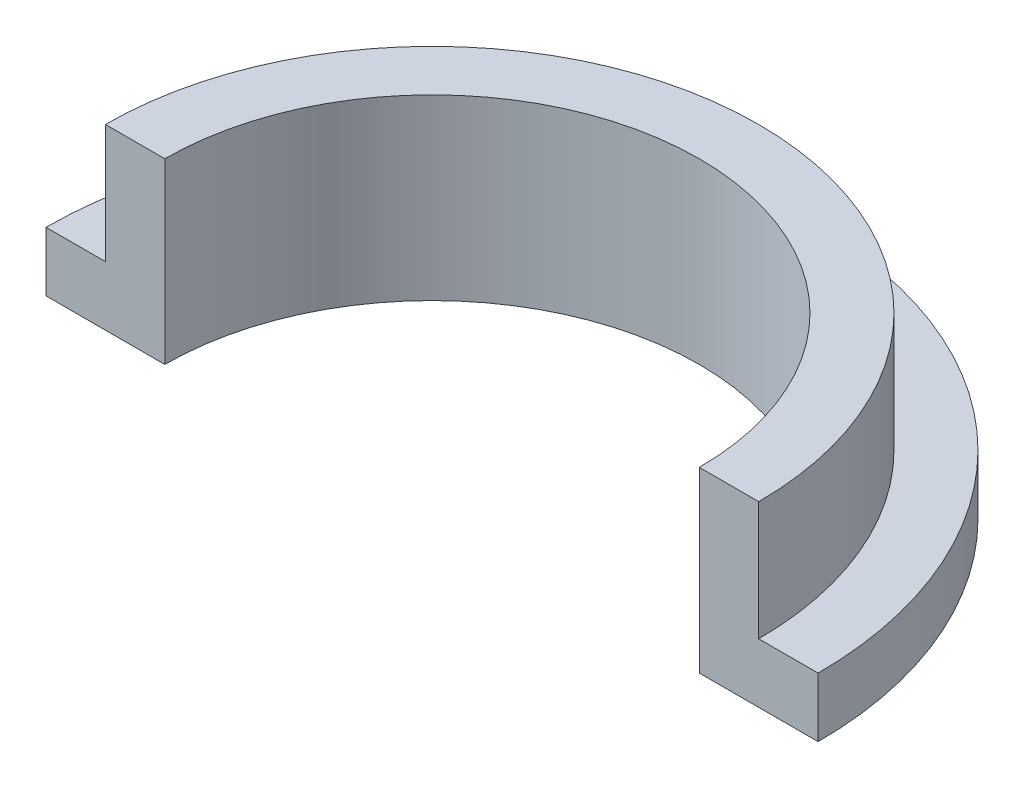
ISO-10303-21;
HEADER;
FILE_DESCRIPTION(('STEP AP214'),'2;1');
FILE_NAME('part.step','',(''),(''),'','','');
FILE_SCHEMA(('AUTOMOTIVE_DESIGN { 1 0 10303 214 1 1 1 1 }'));
ENDSEC;
DATA;
#1=APPLICATION_CONTEXT('core data for automotive mechanical design processes');
#2=APPLICATION_PROTOCOL_DEFINITION('international standard','automotive_design',2000,#1);
#3=PRODUCT_CONTEXT('',#1,'mechanical');
#4=PRODUCT('Part','Part','',(#3));
#5=PRODUCT_RELATED_PRODUCT_CATEGORY('part','',(#4));
#6=PRODUCT_DEFINITION_FORMATION('','',#4);
#7=PRODUCT_DEFINITION_CONTEXT('part definition',#1,'design');
#8=PRODUCT_DEFINITION('design','',#6,#7);
#9=PRODUCT_DEFINITION_SHAPE('','',#8);
#10=(LENGTH_UNIT() NAMED_UNIT(*) SI_UNIT(.MILLI.,.METRE.));
#11=(NAMED_UNIT(*) PLANE_ANGLE_UNIT() SI_UNIT($,.RADIAN.));
#12=(NAMED_UNIT(*) SI_UNIT($,.STERADIAN.) SOLID_ANGLE_UNIT());
#13=UNCERTAINTY_MEASURE_WITH_UNIT(LENGTH_MEASURE(1.E-05),#10,'distance_accuracy_value','');
#14=(GEOMETRIC_REPRESENTATION_CONTEXT(3) GLOBAL_UNCERTAINTY_ASSIGNED_CONTEXT((#13)) GLOBAL_UNIT_ASSIGNED_CONTEXT((#10,
#11,#12)) REPRESENTATION_CONTEXT('',''));
#15=CARTESIAN_POINT('',(0.,0.,0.));
#16=DIRECTION('',(0.,0.,1.));
#17=DIRECTION('',(1.,0.,0.));
#18=AXIS2_PLACEMENT_3D('',#15,#16,#17);
#19=CARTESIAN_POINT('',(0.,6.,0.));
#20=DIRECTION('',(0.,-1.,0.));
#21=DIRECTION('',(0.,0.,-1.));
#22=AXIS2_PLACEMENT_3D('',#19,#20,#21);
#23=CYLINDRICAL_SURFACE('',#22,13.);
#24=CARTESIAN_POINT('',(0.,2.,0.));
#25=DIRECTION('',(0.,1.,0.));
#26=DIRECTION('',(0.,0.,1.));
#27=AXIS2_PLACEMENT_3D('',#24,#25,#26);
#28=CIRCLE('',#27,13.);
#29=CARTESIAN_POINT('',(13.,2.,0.));
#30=VERTEX_POINT('',#29);
#31=CARTESIAN_POINT('',(-13.,2.,0.));
#32=VERTEX_POINT('',#31);
#33=EDGE_CURVE('E126',#30,#32,#28,.T.);
#34=ORIENTED_EDGE('',*,*,#33,.F.);
#35=DIRECTION('',(0.,-1.,0.));
#36=VECTOR('',#35,1.);
#37=CARTESIAN_POINT('',(13.,6.,0.));
#38=LINE('',#37,#36);
#39=CARTESIAN_POINT('',(13.,0.,0.));
#40=VERTEX_POINT('',#39);
#41=EDGE_CURVE('E48',#30,#40,#38,.T.);
#42=ORIENTED_EDGE('',*,*,#41,.T.);
#43=CARTESIAN_POINT('',(0.,0.,0.));
#44=DIRECTION('',(0.,1.,0.));
#45=DIRECTION('',(0.,0.,1.));
#46=AXIS2_PLACEMENT_3D('',#43,#44,#45);
#47=CIRCLE('',#46,13.);
#48=CARTESIAN_POINT('',(-13.,0.,0.));
#49=VERTEX_POINT('',#48);
#50=EDGE_CURVE('E96',#40,#49,#47,.T.);
#51=ORIENTED_EDGE('',*,*,#50,.T.);
#52=DIRECTION('',(0.,-1.,0.));
#53=VECTOR('',#52,1.);
#54=CARTESIAN_POINT('',(-13.,6.,0.));
#55=LINE('',#54,#53);
#56=EDGE_CURVE('E89',#32,#49,#55,.T.);
#57=ORIENTED_EDGE('',*,*,#56,.F.);
#58=EDGE_LOOP('',(#34,#42,#51,#57));
#59=FACE_BOUND('',#58,.T.);
#60=ADVANCED_FACE('F39',(#59),#23,.T.);
#61=CARTESIAN_POINT('',(0.,6.,0.));
#62=DIRECTION('',(0.,-1.,0.));
#63=DIRECTION('',(0.,0.,-1.));
#64=AXIS2_PLACEMENT_3D('',#61,#62,#63);
#65=CYLINDRICAL_SURFACE('',#64,9.);
#66=CARTESIAN_POINT('',(0.,0.,0.));
#67=DIRECTION('',(0.,-1.,0.));
#68=DIRECTION('',(0.,0.,1.));
#69=AXIS2_PLACEMENT_3D('',#66,#67,#68);
#70=CIRCLE('',#69,9.);
#71=CARTESIAN_POINT('',(-9.,0.,0.));
#72=VERTEX_POINT('',#71);
#73=CARTESIAN_POINT('',(9.,0.,0.));
#74=VERTEX_POINT('',#73);
#75=EDGE_CURVE('E101',#72,#74,#70,.T.);
#76=ORIENTED_EDGE('',*,*,#75,.T.);
#77=DIRECTION('',(0.,-1.,0.));
#78=VECTOR('',#77,1.);
#79=CARTESIAN_POINT('',(9.,6.,0.));
#80=LINE('',#79,#78);
#81=CARTESIAN_POINT('',(9.,6.,0.));
#82=VERTEX_POINT('',#81);
#83=EDGE_CURVE('E11',#82,#74,#80,.T.);
#84=ORIENTED_EDGE('',*,*,#83,.F.);
#85=CARTESIAN_POINT('',(0.,6.,0.));
#86=DIRECTION('',(0.,-1.,0.));
#87=DIRECTION('',(0.,0.,1.));
#88=AXIS2_PLACEMENT_3D('',#85,#86,#87);
#89=CIRCLE('',#88,9.);
#90=CARTESIAN_POINT('',(-9.,6.,0.));
#91=VERTEX_POINT('',#90);
#92=EDGE_CURVE('E95',#91,#82,#89,.T.);
#93=ORIENTED_EDGE('',*,*,#92,.F.);
#94=DIRECTION('',(0.,-1.,0.));
#95=VECTOR('',#94,1.);
#96=CARTESIAN_POINT('',(-9.,6.,0.));
#97=LINE('',#96,#95);
#98=EDGE_CURVE('E85',#91,#72,#97,.T.);
#99=ORIENTED_EDGE('',*,*,#98,.T.);
#100=EDGE_LOOP('',(#76,#84,#93,#99));
#101=FACE_BOUND('',#100,.T.);
#102=ADVANCED_FACE('F41',(#101),#65,.F.);
#103=CARTESIAN_POINT('',(9.,6.,0.));
#104=DIRECTION('',(0.,0.,-1.));
#105=DIRECTION('',(-1.,0.,0.));
#106=AXIS2_PLACEMENT_3D('',#103,#104,#105);
#107=PLANE('',#106);
#108=DIRECTION('',(1.,0.,0.));
#109=VECTOR('',#108,1.);
#110=CARTESIAN_POINT('',(11.,2.,0.));
#111=LINE('',#110,#109);
#112=CARTESIAN_POINT('',(11.,2.,0.));
#113=VERTEX_POINT('',#112);
#114=EDGE_CURVE('E140',#113,#30,#111,.T.);
#115=ORIENTED_EDGE('',*,*,#114,.F.);
#116=DIRECTION('',(0.,1.,0.));
#117=VECTOR('',#116,1.);
#118=CARTESIAN_POINT('',(11.,2.,0.));
#119=LINE('',#118,#117);
#120=CARTESIAN_POINT('',(11.,6.,0.));
#121=VERTEX_POINT('',#120);
#122=EDGE_CURVE('E108',#113,#121,#119,.T.);
#123=ORIENTED_EDGE('',*,*,#122,.T.);
#124=DIRECTION('',(1.,0.,0.));
#125=VECTOR('',#124,1.);
#126=CARTESIAN_POINT('',(9.,6.,0.));
#127=LINE('',#126,#125);
#128=EDGE_CURVE('E131',#82,#121,#127,.T.);
#129=ORIENTED_EDGE('',*,*,#128,.F.);
#130=ORIENTED_EDGE('',*,*,#83,.T.);
#131=DIRECTION('',(1.,0.,0.));
#132=VECTOR('',#131,1.);
#133=CARTESIAN_POINT('',(9.,0.,0.));
#134=LINE('',#133,#132);
#135=EDGE_CURVE('E106',#74,#40,#134,.T.);
#136=ORIENTED_EDGE('',*,*,#135,.T.);
#137=ORIENTED_EDGE('',*,*,#41,.F.);
#138=EDGE_LOOP('',(#115,#123,#129,#130,#136,#137));
#139=FACE_BOUND('',#138,.T.);
#140=ADVANCED_FACE('F129',(#139),#107,.F.);
#141=CARTESIAN_POINT('',(-13.,6.,0.));
#142=DIRECTION('',(0.,0.,-1.));
#143=DIRECTION('',(-1.,0.,0.));
#144=AXIS2_PLACEMENT_3D('',#141,#142,#143);
#145=PLANE('',#144);
#146=DIRECTION('',(1.,0.,0.));
#147=VECTOR('',#146,1.);
#148=CARTESIAN_POINT('',(-13.,6.,0.));
#149=LINE('',#148,#147);
#150=CARTESIAN_POINT('',(-11.,6.,0.));
#151=VERTEX_POINT('',#150);
#152=EDGE_CURVE('E63',#151,#91,#149,.T.);
#153=ORIENTED_EDGE('',*,*,#152,.F.);
#154=DIRECTION('',(0.,1.,0.));
#155=VECTOR('',#154,1.);
#156=CARTESIAN_POINT('',(-11.,2.,0.));
#157=LINE('',#156,#155);
#158=CARTESIAN_POINT('',(-11.,2.,0.));
#159=VERTEX_POINT('',#158);
#160=EDGE_CURVE('E55',#159,#151,#157,.T.);
#161=ORIENTED_EDGE('',*,*,#160,.F.);
#162=DIRECTION('',(1.,0.,0.));
#163=VECTOR('',#162,1.);
#164=CARTESIAN_POINT('',(-13.,2.,0.));
#165=LINE('',#164,#163);
#166=EDGE_CURVE('E152',#32,#159,#165,.T.);
#167=ORIENTED_EDGE('',*,*,#166,.F.);
#168=ORIENTED_EDGE('',*,*,#56,.T.);
#169=DIRECTION('',(1.,0.,0.));
#170=VECTOR('',#169,1.);
#171=CARTESIAN_POINT('',(-13.,0.,0.));
#172=LINE('',#171,#170);
#173=EDGE_CURVE('E82',#49,#72,#172,.T.);
#174=ORIENTED_EDGE('',*,*,#173,.T.);
#175=ORIENTED_EDGE('',*,*,#98,.F.);
#176=EDGE_LOOP('',(#153,#161,#167,#168,#174,#175));
#177=FACE_BOUND('',#176,.T.);
#178=ADVANCED_FACE('F84',(#177),#145,.F.);
#179=CARTESIAN_POINT('',(0.,6.,0.));
#180=DIRECTION('',(0.,1.,0.));
#181=DIRECTION('',(0.,0.,1.));
#182=AXIS2_PLACEMENT_3D('',#179,#180,#181);
#183=PLANE('',#182);
#184=CARTESIAN_POINT('',(0.,6.,0.));
#185=DIRECTION('',(0.,-1.,0.));
#186=DIRECTION('',(0.,0.,1.));
#187=AXIS2_PLACEMENT_3D('',#184,#185,#186);
#188=CIRCLE('',#187,11.);
#189=EDGE_CURVE('E142',#151,#121,#188,.T.);
#190=ORIENTED_EDGE('',*,*,#189,.F.);
#191=ORIENTED_EDGE('',*,*,#152,.T.);
#192=ORIENTED_EDGE('',*,*,#92,.T.);
#193=ORIENTED_EDGE('',*,*,#128,.T.);
#194=EDGE_LOOP('',(#190,#191,#192,#193));
#195=FACE_BOUND('',#194,.T.);
#196=ADVANCED_FACE('F135',(#195),#183,.T.);
#197=CARTESIAN_POINT('',(0.,0.,0.));
#198=DIRECTION('',(0.,1.,0.));
#199=DIRECTION('',(0.,0.,1.));
#200=AXIS2_PLACEMENT_3D('',#197,#198,#199);
#201=PLANE('',#200);
#202=ORIENTED_EDGE('',*,*,#75,.F.);
#203=ORIENTED_EDGE('',*,*,#173,.F.);
#204=ORIENTED_EDGE('',*,*,#50,.F.);
#205=ORIENTED_EDGE('',*,*,#135,.F.);
#206=EDGE_LOOP('',(#202,#203,#204,#205));
#207=FACE_BOUND('',#206,.T.);
#208=ADVANCED_FACE('F104',(#207),#201,.F.);
#209=CARTESIAN_POINT('',(0.,2.,0.));
#210=DIRECTION('',(0.,1.,0.));
#211=DIRECTION('',(0.,0.,1.));
#212=AXIS2_PLACEMENT_3D('',#209,#210,#211);
#213=CYLINDRICAL_SURFACE('',#212,11.);
#214=ORIENTED_EDGE('',*,*,#189,.T.);
#215=ORIENTED_EDGE('',*,*,#122,.F.);
#216=CARTESIAN_POINT('',(0.,2.,0.));
#217=DIRECTION('',(0.,-1.,0.));
#218=DIRECTION('',(0.,0.,1.));
#219=AXIS2_PLACEMENT_3D('',#216,#217,#218);
#220=CIRCLE('',#219,11.);
#221=EDGE_CURVE('E148',#159,#113,#220,.T.);
#222=ORIENTED_EDGE('',*,*,#221,.F.);
#223=ORIENTED_EDGE('',*,*,#160,.T.);
#224=EDGE_LOOP('',(#214,#215,#222,#223));
#225=FACE_BOUND('',#224,.T.);
#226=ADVANCED_FACE('F166',(#225),#213,.T.);
#227=CARTESIAN_POINT('',(0.,2.,0.));
#228=DIRECTION('',(0.,1.,0.));
#229=DIRECTION('',(0.,0.,1.));
#230=AXIS2_PLACEMENT_3D('',#227,#228,#229);
#231=PLANE('',#230);
#232=ORIENTED_EDGE('',*,*,#33,.T.);
#233=ORIENTED_EDGE('',*,*,#166,.T.);
#234=ORIENTED_EDGE('',*,*,#221,.T.);
#235=ORIENTED_EDGE('',*,*,#114,.T.);
#236=EDGE_LOOP('',(#232,#233,#234,#235));
#237=FACE_BOUND('',#236,.T.);
#238=ADVANCED_FACE('F159',(#237),#231,.T.);
#239=CLOSED_SHELL('',(#60,#102,#140,#178,#196,#208,#226,#238));
#240=MANIFOLD_SOLID_BREP('B2',#239);
#241=ADVANCED_BREP_SHAPE_REPRESENTATION('',(#18,#240),#14);
#242=SHAPE_DEFINITION_REPRESENTATION(#9,#241);
ENDSEC;
END-ISO-10303-21;
